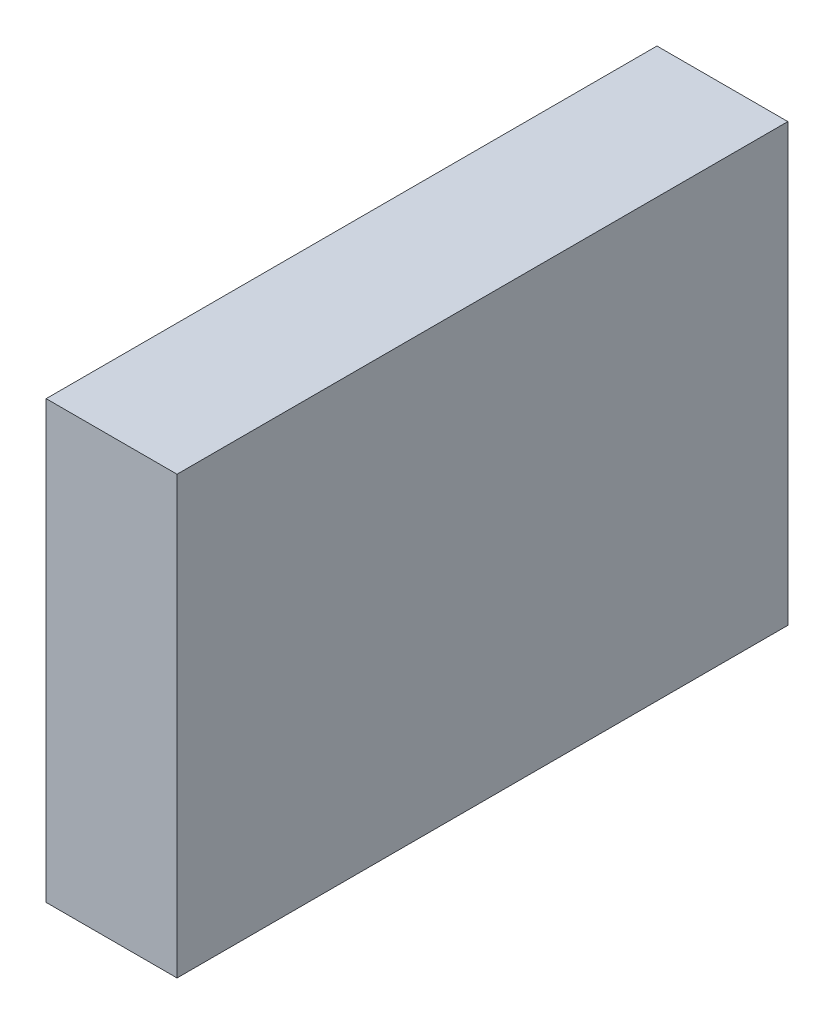
ISO-10303-21;
HEADER;
FILE_DESCRIPTION(('STEP AP214'),'2;1');
FILE_NAME('part.step','',(''),(''),'','','');
FILE_SCHEMA(('AUTOMOTIVE_DESIGN { 1 0 10303 214 1 1 1 1 }'));
ENDSEC;
DATA;
#1=APPLICATION_CONTEXT('core data for automotive mechanical design processes');
#2=APPLICATION_PROTOCOL_DEFINITION('international standard','automotive_design',2000,#1);
#3=PRODUCT_CONTEXT('',#1,'mechanical');
#4=PRODUCT('Part','Part','',(#3));
#5=PRODUCT_RELATED_PRODUCT_CATEGORY('part','',(#4));
#6=PRODUCT_DEFINITION_FORMATION('','',#4);
#7=PRODUCT_DEFINITION_CONTEXT('part definition',#1,'design');
#8=PRODUCT_DEFINITION('design','',#6,#7);
#9=PRODUCT_DEFINITION_SHAPE('','',#8);
#10=(LENGTH_UNIT() NAMED_UNIT(*) SI_UNIT(.MILLI.,.METRE.));
#11=(NAMED_UNIT(*) PLANE_ANGLE_UNIT() SI_UNIT($,.RADIAN.));
#12=(NAMED_UNIT(*) SI_UNIT($,.STERADIAN.) SOLID_ANGLE_UNIT());
#13=UNCERTAINTY_MEASURE_WITH_UNIT(LENGTH_MEASURE(1.E-05),#10,'distance_accuracy_value','');
#14=(GEOMETRIC_REPRESENTATION_CONTEXT(3) GLOBAL_UNCERTAINTY_ASSIGNED_CONTEXT((#13)) GLOBAL_UNIT_ASSIGNED_CONTEXT((#10,
#11,#12)) REPRESENTATION_CONTEXT('',''));
#15=CARTESIAN_POINT('',(0.,0.,0.));
#16=DIRECTION('',(0.,0.,1.));
#17=DIRECTION('',(1.,0.,0.));
#18=AXIS2_PLACEMENT_3D('',#15,#16,#17);
#19=CARTESIAN_POINT('',(-2.99999988110505,0.680000347067423,-3.72112146154861));
#20=DIRECTION('',(1.,-1.74845553146952E-07,0.));
#21=DIRECTION('',(1.74845553146952E-07,1.,8.74227765734759E-08));
#22=AXIS2_PLACEMENT_3D('',#19,#20,#21);
#23=PLANE('',#22);
#24=DIRECTION('',(1.74845553146599E-07,0.999999999999981,8.74227765732994E-08));
#25=VECTOR('',#24,1.);
#26=CARTESIAN_POINT('',(-2.99999986886587,0.750000340946829,-3.65112145542901));
#27=LINE('',#26,#25);
#28=CARTESIAN_POINT('',(-2.99999986886587,0.750000340947829,-3.65112145542901));
#29=VERTEX_POINT('',#28);
#30=CARTESIAN_POINT('',(-2.99999969402031,1.75000034094883,-3.65112136800523));
#31=VERTEX_POINT('',#30);
#32=EDGE_CURVE('E11',#29,#31,#27,.T.);
#33=ORIENTED_EDGE('',*,*,#32,.T.);
#34=DIRECTION('',(0.,-8.74227764783136E-08,0.999999999999996));
#35=VECTOR('',#34,1.);
#36=CARTESIAN_POINT('',(-2.99999969402031,1.75000034094883,-3.65112136800623));
#37=LINE('',#36,#35);
#38=CARTESIAN_POINT('',(-2.99999969402034,1.75000021855594,-2.25112136800623));
#39=VERTEX_POINT('',#38);
#40=EDGE_CURVE('E69',#31,#39,#37,.T.);
#41=ORIENTED_EDGE('',*,*,#40,.T.);
#42=DIRECTION('',(-1.74845553146599E-07,-0.999999999999981,-8.74227765732993E-08));
#43=VECTOR('',#42,1.);
#44=CARTESIAN_POINT('',(-2.99999969402034,1.75000021855694,-2.25112136800623));
#45=LINE('',#44,#43);
#46=CARTESIAN_POINT('',(-2.99999986886589,0.750000218554942,-2.25112145543001));
#47=VERTEX_POINT('',#46);
#48=EDGE_CURVE('E55',#39,#47,#45,.T.);
#49=ORIENTED_EDGE('',*,*,#48,.T.);
#50=DIRECTION('',(0.,8.74227765576152E-08,-0.999999999999996));
#51=VECTOR('',#50,1.);
#52=CARTESIAN_POINT('',(-2.99999986886589,0.750000218554942,-2.25112145542901));
#53=LINE('',#52,#51);
#54=EDGE_CURVE('E53',#47,#29,#53,.T.);
#55=ORIENTED_EDGE('',*,*,#54,.T.);
#56=EDGE_LOOP('',(#33,#41,#49,#55));
#57=FACE_BOUND('',#56,.T.);
#58=ADVANCED_FACE('F17',(#57),#23,.T.);
#59=CARTESIAN_POINT('',(-3.29999988110505,0.680000399521089,-3.72112146154861));
#60=DIRECTION('',(1.,-1.74845553146952E-07,0.));
#61=DIRECTION('',(1.74845553146952E-07,1.,8.74227765734759E-08));
#62=AXIS2_PLACEMENT_3D('',#59,#60,#61);
#63=PLANE('',#62);
#64=DIRECTION('',(0.,8.74227765576152E-08,-0.999999999999996));
#65=VECTOR('',#64,1.);
#66=CARTESIAN_POINT('',(-3.29999986886589,0.750000271008607,-2.25112145542901));
#67=LINE('',#66,#65);
#68=CARTESIAN_POINT('',(-3.29999986886589,0.750000271008607,-2.25112145543001));
#69=VERTEX_POINT('',#68);
#70=CARTESIAN_POINT('',(-3.29999986886587,0.750000393401495,-3.65112145542901));
#71=VERTEX_POINT('',#70);
#72=EDGE_CURVE('E24',#69,#71,#67,.T.);
#73=ORIENTED_EDGE('',*,*,#72,.F.);
#74=DIRECTION('',(-1.74845553146599E-07,-0.999999999999981,-8.74227765732993E-08));
#75=VECTOR('',#74,1.);
#76=CARTESIAN_POINT('',(-3.29999969402034,1.75000027101061,-2.25112136800623));
#77=LINE('',#76,#75);
#78=CARTESIAN_POINT('',(-3.29999969402034,1.75000027100961,-2.25112136800623));
#79=VERTEX_POINT('',#78);
#80=EDGE_CURVE('E70',#79,#69,#77,.T.);
#81=ORIENTED_EDGE('',*,*,#80,.F.);
#82=DIRECTION('',(0.,-8.74227766369168E-08,0.999999999999996));
#83=VECTOR('',#82,1.);
#84=CARTESIAN_POINT('',(-3.29999969402031,1.75000039340249,-3.65112136800624));
#85=LINE('',#84,#83);
#86=CARTESIAN_POINT('',(-3.29999969402031,1.75000039340249,-3.65112136800523));
#87=VERTEX_POINT('',#86);
#88=EDGE_CURVE('E59',#87,#79,#85,.T.);
#89=ORIENTED_EDGE('',*,*,#88,.F.);
#90=DIRECTION('',(1.74845553146599E-07,0.999999999999981,8.74227765732994E-08));
#91=VECTOR('',#90,1.);
#92=CARTESIAN_POINT('',(-3.29999986886587,0.750000393400494,-3.65112145542901));
#93=LINE('',#92,#91);
#94=EDGE_CURVE('E78',#71,#87,#93,.T.);
#95=ORIENTED_EDGE('',*,*,#94,.F.);
#96=EDGE_LOOP('',(#73,#81,#89,#95));
#97=FACE_BOUND('',#96,.T.);
#98=ADVANCED_FACE('F89',(#97),#63,.F.);
#99=CARTESIAN_POINT('',(-2.99999986886587,0.750000340946829,-3.65112145542901));
#100=DIRECTION('',(0.,-8.74227765734759E-08,1.));
#101=DIRECTION('',(1.74845553146952E-07,1.,8.74227765734759E-08));
#102=AXIS2_PLACEMENT_3D('',#99,#100,#101);
#103=PLANE('',#102);
#104=DIRECTION('',(-0.999999999999985,1.74845553220964E-07,0.));
#105=VECTOR('',#104,1.);
#106=CARTESIAN_POINT('',(-2.99999986886587,0.750000340946829,-3.65112145542901));
#107=LINE('',#106,#105);
#108=EDGE_CURVE('E65',#29,#71,#107,.T.);
#109=ORIENTED_EDGE('',*,*,#108,.T.);
#110=ORIENTED_EDGE('',*,*,#94,.T.);
#111=DIRECTION('',(-0.999999999999985,1.7484555285089E-07,0.));
#112=VECTOR('',#111,1.);
#113=CARTESIAN_POINT('',(-2.99999969402031,1.75000034094883,-3.65112136800624));
#114=LINE('',#113,#112);
#115=EDGE_CURVE('E66',#31,#87,#114,.T.);
#116=ORIENTED_EDGE('',*,*,#115,.F.);
#117=ORIENTED_EDGE('',*,*,#32,.F.);
#118=EDGE_LOOP('',(#109,#110,#116,#117));
#119=FACE_BOUND('',#118,.T.);
#120=ADVANCED_FACE('F63',(#119),#103,.F.);
#121=CARTESIAN_POINT('',(-2.99999969402031,1.75000034094883,-3.65112136800623));
#122=DIRECTION('',(-1.74845553146952E-07,-1.,-8.74227765734759E-08));
#123=DIRECTION('',(0.,-8.74227765734759E-08,1.));
#124=AXIS2_PLACEMENT_3D('',#121,#122,#123);
#125=PLANE('',#124);
#126=ORIENTED_EDGE('',*,*,#115,.T.);
#127=ORIENTED_EDGE('',*,*,#88,.T.);
#128=DIRECTION('',(-0.999999999999985,1.7484555285089E-07,0.));
#129=VECTOR('',#128,1.);
#130=CARTESIAN_POINT('',(-2.99999969402034,1.75000021855694,-2.25112136800623));
#131=LINE('',#130,#129);
#132=EDGE_CURVE('E60',#39,#79,#131,.T.);
#133=ORIENTED_EDGE('',*,*,#132,.F.);
#134=ORIENTED_EDGE('',*,*,#40,.F.);
#135=EDGE_LOOP('',(#126,#127,#133,#134));
#136=FACE_BOUND('',#135,.T.);
#137=ADVANCED_FACE('F91',(#136),#125,.F.);
#138=CARTESIAN_POINT('',(-2.99999969402034,1.75000021855694,-2.25112136800623));
#139=DIRECTION('',(0.,8.74227765734759E-08,-1.));
#140=DIRECTION('',(-1.74845553146952E-07,-1.,-8.74227765734759E-08));
#141=AXIS2_PLACEMENT_3D('',#138,#139,#140);
#142=PLANE('',#141);
#143=ORIENTED_EDGE('',*,*,#132,.T.);
#144=ORIENTED_EDGE('',*,*,#80,.T.);
#145=DIRECTION('',(-0.999999999999985,1.74845553220964E-07,0.));
#146=VECTOR('',#145,1.);
#147=CARTESIAN_POINT('',(-2.99999986886589,0.750000218554942,-2.25112145542901));
#148=LINE('',#147,#146);
#149=EDGE_CURVE('E84',#47,#69,#148,.T.);
#150=ORIENTED_EDGE('',*,*,#149,.F.);
#151=ORIENTED_EDGE('',*,*,#48,.F.);
#152=EDGE_LOOP('',(#143,#144,#150,#151));
#153=FACE_BOUND('',#152,.T.);
#154=ADVANCED_FACE('F86',(#153),#142,.F.);
#155=CARTESIAN_POINT('',(-2.99999986886589,0.750000218554942,-2.25112145542901));
#156=DIRECTION('',(1.74845553146952E-07,1.,8.74227765734759E-08));
#157=DIRECTION('',(0.,8.74227765734759E-08,-1.));
#158=AXIS2_PLACEMENT_3D('',#155,#156,#157);
#159=PLANE('',#158);
#160=ORIENTED_EDGE('',*,*,#149,.T.);
#161=ORIENTED_EDGE('',*,*,#72,.T.);
#162=ORIENTED_EDGE('',*,*,#108,.F.);
#163=ORIENTED_EDGE('',*,*,#54,.F.);
#164=EDGE_LOOP('',(#160,#161,#162,#163));
#165=FACE_BOUND('',#164,.T.);
#166=ADVANCED_FACE('F68',(#165),#159,.F.);
#167=CLOSED_SHELL('',(#58,#98,#120,#137,#154,#166));
#168=MANIFOLD_SOLID_BREP('B1',#167);
#169=ADVANCED_BREP_SHAPE_REPRESENTATION('',(#18,#168),#14);
#170=SHAPE_DEFINITION_REPRESENTATION(#9,#169);
ENDSEC;
END-ISO-10303-21;
